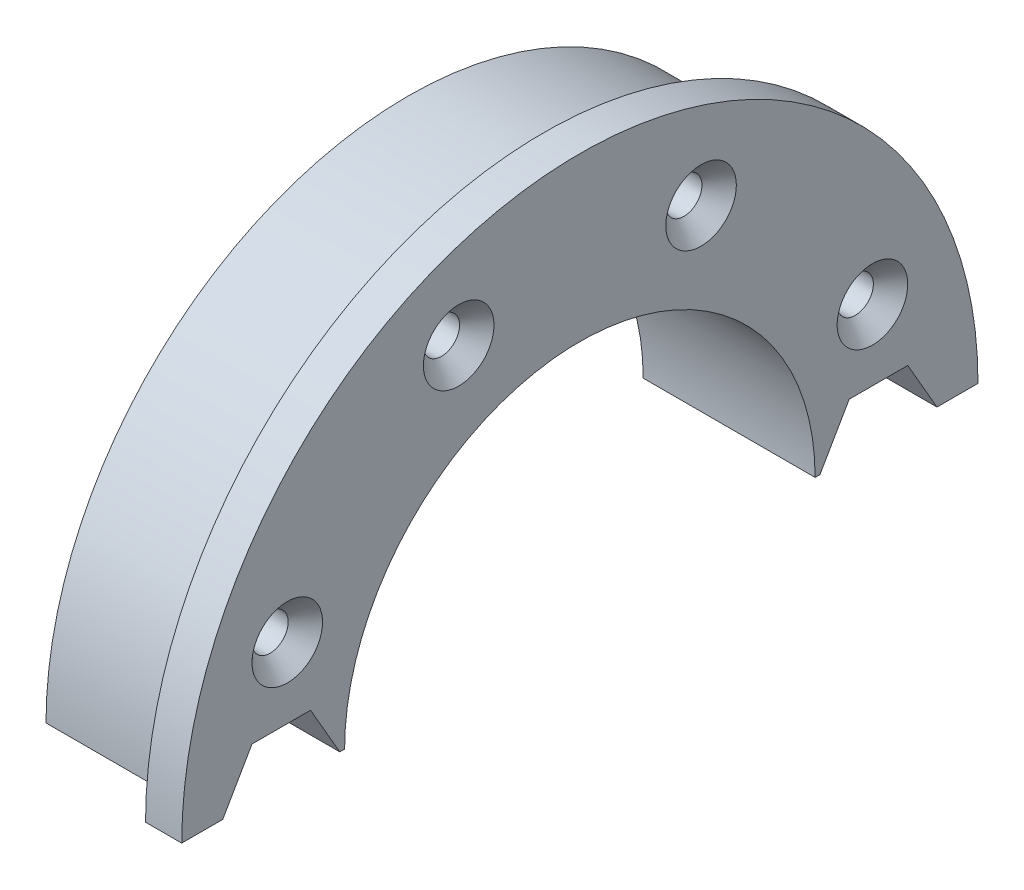
ISO-10303-21;
HEADER;
FILE_DESCRIPTION(('STEP AP214'),'2;1');
FILE_NAME('part.step','',(''),(''),'','','');
FILE_SCHEMA(('AUTOMOTIVE_DESIGN { 1 0 10303 214 1 1 1 1 }'));
ENDSEC;
DATA;
#1=APPLICATION_CONTEXT('core data for automotive mechanical design processes');
#2=APPLICATION_PROTOCOL_DEFINITION('international standard','automotive_design',2000,#1);
#3=PRODUCT_CONTEXT('',#1,'mechanical');
#4=PRODUCT('Part','Part','',(#3));
#5=PRODUCT_RELATED_PRODUCT_CATEGORY('part','',(#4));
#6=PRODUCT_DEFINITION_FORMATION('','',#4);
#7=PRODUCT_DEFINITION_CONTEXT('part definition',#1,'design');
#8=PRODUCT_DEFINITION('design','',#6,#7);
#9=PRODUCT_DEFINITION_SHAPE('','',#8);
#10=(LENGTH_UNIT() NAMED_UNIT(*) SI_UNIT(.MILLI.,.METRE.));
#11=(NAMED_UNIT(*) PLANE_ANGLE_UNIT() SI_UNIT($,.RADIAN.));
#12=(NAMED_UNIT(*) SI_UNIT($,.STERADIAN.) SOLID_ANGLE_UNIT());
#13=UNCERTAINTY_MEASURE_WITH_UNIT(LENGTH_MEASURE(1.E-05),#10,'distance_accuracy_value','');
#14=(GEOMETRIC_REPRESENTATION_CONTEXT(3) GLOBAL_UNCERTAINTY_ASSIGNED_CONTEXT((#13)) GLOBAL_UNIT_ASSIGNED_CONTEXT((#10,
#11,#12)) REPRESENTATION_CONTEXT('',''));
#15=CARTESIAN_POINT('',(0.,0.,0.));
#16=DIRECTION('',(0.,0.,1.));
#17=DIRECTION('',(1.,0.,0.));
#18=AXIS2_PLACEMENT_3D('',#15,#16,#17);
#19=CARTESIAN_POINT('',(0.,0.,0.));
#20=DIRECTION('',(0.,1.,0.));
#21=DIRECTION('',(-1.,0.,0.));
#22=AXIS2_PLACEMENT_3D('',#19,#20,#21);
#23=PLANE('',#22);
#24=DIRECTION('',(0.,0.,-1.));
#25=VECTOR('',#24,1.);
#26=CARTESIAN_POINT('',(1.5,0.,0.));
#27=LINE('',#26,#25);
#28=CARTESIAN_POINT('',(1.5,0.,14.9));
#29=VERTEX_POINT('',#28);
#30=CARTESIAN_POINT('',(1.5,0.,13.2668384925381));
#31=VERTEX_POINT('',#30);
#32=EDGE_CURVE('E225',#29,#31,#27,.T.);
#33=ORIENTED_EDGE('',*,*,#32,.F.);
#34=DIRECTION('',(-1.,0.,0.));
#35=VECTOR('',#34,1.);
#36=CARTESIAN_POINT('',(-4.,0.,14.9));
#37=LINE('',#36,#35);
#38=CARTESIAN_POINT('',(-1.9,0.,14.9));
#39=VERTEX_POINT('',#38);
#40=EDGE_CURVE('E41',#29,#39,#37,.T.);
#41=ORIENTED_EDGE('',*,*,#40,.T.);
#42=DIRECTION('',(0.,0.,-1.));
#43=VECTOR('',#42,1.);
#44=CARTESIAN_POINT('',(-1.9,0.,0.));
#45=LINE('',#44,#43);
#46=CARTESIAN_POINT('',(-1.9,0.,13.7));
#47=VERTEX_POINT('',#46);
#48=EDGE_CURVE('E187',#39,#47,#45,.T.);
#49=ORIENTED_EDGE('',*,*,#48,.T.);
#50=DIRECTION('',(-1.,0.,0.));
#51=VECTOR('',#50,1.);
#52=CARTESIAN_POINT('',(-4.,0.,13.7));
#53=LINE('',#52,#51);
#54=CARTESIAN_POINT('',(-4.,0.,13.7));
#55=VERTEX_POINT('',#54);
#56=EDGE_CURVE('E180',#47,#55,#53,.T.);
#57=ORIENTED_EDGE('',*,*,#56,.T.);
#58=DIRECTION('',(0.,0.,-1.));
#59=VECTOR('',#58,1.);
#60=CARTESIAN_POINT('',(-4.,0.,20.));
#61=LINE('',#60,#59);
#62=CARTESIAN_POINT('',(-3.99999999999999,0.,13.));
#63=VERTEX_POINT('',#62);
#64=EDGE_CURVE('E422',#55,#63,#61,.T.);
#65=ORIENTED_EDGE('',*,*,#64,.T.);
#66=DIRECTION('',(1.,0.,0.));
#67=VECTOR('',#66,1.);
#68=CARTESIAN_POINT('',(-3.99999999999999,0.,13.));
#69=LINE('',#68,#67);
#70=CARTESIAN_POINT('',(5.5,0.,13.));
#71=VERTEX_POINT('',#70);
#72=EDGE_CURVE('E425',#63,#71,#69,.T.);
#73=ORIENTED_EDGE('',*,*,#72,.T.);
#74=DIRECTION('',(0.,0.,1.));
#75=VECTOR('',#74,1.);
#76=CARTESIAN_POINT('',(5.5,0.,22.));
#77=LINE('',#76,#75);
#78=CARTESIAN_POINT('',(5.5,0.,13.2668384925381));
#79=VERTEX_POINT('',#78);
#80=EDGE_CURVE('E429',#71,#79,#77,.T.);
#81=ORIENTED_EDGE('',*,*,#80,.T.);
#82=DIRECTION('',(1.,0.,0.));
#83=VECTOR('',#82,1.);
#84=CARTESIAN_POINT('',(1.5,0.,13.2668384925381));
#85=LINE('',#84,#83);
#86=EDGE_CURVE('E374',#31,#79,#85,.T.);
#87=ORIENTED_EDGE('',*,*,#86,.F.);
#88=EDGE_LOOP('',(#33,#41,#49,#57,#65,#73,#81,#87));
#89=FACE_BOUND('',#88,.T.);
#90=ADVANCED_FACE('F33',(#89),#23,.F.);
#91=CARTESIAN_POINT('',(0.,0.,0.));
#92=DIRECTION('',(0.,-1.,0.));
#93=DIRECTION('',(-1.,0.,0.));
#94=AXIS2_PLACEMENT_3D('',#91,#92,#93);
#95=PLANE('',#94);
#96=DIRECTION('',(-1.,0.,0.));
#97=VECTOR('',#96,1.);
#98=CARTESIAN_POINT('',(-4.,0.,-18.1));
#99=LINE('',#98,#97);
#100=CARTESIAN_POINT('',(-1.9,0.,-18.1));
#101=VERTEX_POINT('',#100);
#102=CARTESIAN_POINT('',(1.5,0.,-18.1));
#103=VERTEX_POINT('',#102);
#104=EDGE_CURVE('E56',#101,#103,#99,.F.);
#105=ORIENTED_EDGE('',*,*,#104,.F.);
#106=DIRECTION('',(0.,0.,1.));
#107=VECTOR('',#106,1.);
#108=CARTESIAN_POINT('',(-1.9,0.,0.));
#109=LINE('',#108,#107);
#110=CARTESIAN_POINT('',(-1.9,0.,-19.3));
#111=VERTEX_POINT('',#110);
#112=EDGE_CURVE('E209',#111,#101,#109,.T.);
#113=ORIENTED_EDGE('',*,*,#112,.F.);
#114=DIRECTION('',(-1.,0.,0.));
#115=VECTOR('',#114,1.);
#116=CARTESIAN_POINT('',(-4.,0.,-19.3));
#117=LINE('',#116,#115);
#118=CARTESIAN_POINT('',(-4.,0.,-19.3));
#119=VERTEX_POINT('',#118);
#120=EDGE_CURVE('E207',#119,#111,#117,.F.);
#121=ORIENTED_EDGE('',*,*,#120,.F.);
#122=DIRECTION('',(0.,0.,1.));
#123=VECTOR('',#122,1.);
#124=CARTESIAN_POINT('',(-4.,0.,-20.));
#125=LINE('',#124,#123);
#126=CARTESIAN_POINT('',(-4.,0.,-20.));
#127=VERTEX_POINT('',#126);
#128=EDGE_CURVE('E442',#127,#119,#125,.T.);
#129=ORIENTED_EDGE('',*,*,#128,.F.);
#130=DIRECTION('',(-1.,0.,0.));
#131=VECTOR('',#130,1.);
#132=CARTESIAN_POINT('',(3.50000000000001,0.,-20.));
#133=LINE('',#132,#131);
#134=CARTESIAN_POINT('',(3.50000000000001,0.,-20.));
#135=VERTEX_POINT('',#134);
#136=EDGE_CURVE('E438',#135,#127,#133,.T.);
#137=ORIENTED_EDGE('',*,*,#136,.F.);
#138=DIRECTION('',(0.,0.,1.));
#139=VECTOR('',#138,1.);
#140=CARTESIAN_POINT('',(3.50000000000001,0.,-20.));
#141=LINE('',#140,#139);
#142=CARTESIAN_POINT('',(3.50000000000001,0.,-22.));
#143=VERTEX_POINT('',#142);
#144=EDGE_CURVE('E435',#143,#135,#141,.T.);
#145=ORIENTED_EDGE('',*,*,#144,.F.);
#146=DIRECTION('',(-1.,0.,0.));
#147=VECTOR('',#146,1.);
#148=CARTESIAN_POINT('',(3.50000000000001,0.,-22.));
#149=LINE('',#148,#147);
#150=CARTESIAN_POINT('',(5.5,0.,-22.));
#151=VERTEX_POINT('',#150);
#152=EDGE_CURVE('E452',#151,#143,#149,.T.);
#153=ORIENTED_EDGE('',*,*,#152,.F.);
#154=DIRECTION('',(0.,0.,-1.));
#155=VECTOR('',#154,1.);
#156=CARTESIAN_POINT('',(5.5,0.,-22.));
#157=LINE('',#156,#155);
#158=CARTESIAN_POINT('',(5.5,0.,-19.7331615074619));
#159=VERTEX_POINT('',#158);
#160=EDGE_CURVE('E448',#159,#151,#157,.T.);
#161=ORIENTED_EDGE('',*,*,#160,.F.);
#162=DIRECTION('',(1.,0.,0.));
#163=VECTOR('',#162,1.);
#164=CARTESIAN_POINT('',(1.5,0.,-19.7331615074619));
#165=LINE('',#164,#163);
#166=CARTESIAN_POINT('',(1.5,0.,-19.7331615074619));
#167=VERTEX_POINT('',#166);
#168=EDGE_CURVE('E342',#167,#159,#165,.T.);
#169=ORIENTED_EDGE('',*,*,#168,.F.);
#170=DIRECTION('',(0.,0.,-1.));
#171=VECTOR('',#170,1.);
#172=CARTESIAN_POINT('',(1.5,0.,0.));
#173=LINE('',#172,#171);
#174=EDGE_CURVE('E221',#103,#167,#173,.T.);
#175=ORIENTED_EDGE('',*,*,#174,.F.);
#176=EDGE_LOOP('',(#105,#113,#121,#129,#137,#145,#153,#161,#169,#175));
#177=FACE_BOUND('',#176,.T.);
#178=ADVANCED_FACE('F297',(#177),#95,.T.);
#179=CARTESIAN_POINT('',(3.50000000000001,0.,-20.));
#180=DIRECTION('',(-1.,0.,0.));
#181=DIRECTION('',(0.,-1.,0.));
#182=AXIS2_PLACEMENT_3D('',#179,#180,#181);
#183=PLANE('',#182);
#184=CARTESIAN_POINT('',(3.50000000000001,0.,0.));
#185=DIRECTION('',(1.,0.,0.));
#186=DIRECTION('',(0.,1.,0.));
#187=AXIS2_PLACEMENT_3D('',#184,#185,#186);
#188=CIRCLE('',#187,22.);
#189=CARTESIAN_POINT('',(3.50000000000001,0.,22.));
#190=VERTEX_POINT('',#189);
#191=EDGE_CURVE('E467',#143,#190,#188,.T.);
#192=ORIENTED_EDGE('',*,*,#191,.F.);
#193=ORIENTED_EDGE('',*,*,#144,.T.);
#194=CARTESIAN_POINT('',(3.50000000000001,0.,0.));
#195=DIRECTION('',(1.,0.,0.));
#196=DIRECTION('',(0.,1.,0.));
#197=AXIS2_PLACEMENT_3D('',#194,#195,#196);
#198=CIRCLE('',#197,20.);
#199=CARTESIAN_POINT('',(3.50000000000001,0.,20.));
#200=VERTEX_POINT('',#199);
#201=EDGE_CURVE('E455',#135,#200,#198,.T.);
#202=ORIENTED_EDGE('',*,*,#201,.T.);
#203=DIRECTION('',(0.,0.,-1.));
#204=VECTOR('',#203,1.);
#205=CARTESIAN_POINT('',(3.50000000000001,0.,20.));
#206=LINE('',#205,#204);
#207=EDGE_CURVE('E416',#190,#200,#206,.T.);
#208=ORIENTED_EDGE('',*,*,#207,.F.);
#209=EDGE_LOOP('',(#192,#193,#202,#208));
#210=FACE_BOUND('',#209,.T.);
#211=ADVANCED_FACE('F298',(#210),#183,.T.);
#212=CARTESIAN_POINT('',(0.,0.,0.));
#213=DIRECTION('',(1.,0.,0.));
#214=DIRECTION('',(0.,1.,0.));
#215=AXIS2_PLACEMENT_3D('',#212,#213,#214);
#216=CYLINDRICAL_SURFACE('',#215,22.);
#217=CARTESIAN_POINT('',(5.5,0.,0.));
#218=DIRECTION('',(1.,0.,0.));
#219=DIRECTION('',(0.,1.,0.));
#220=AXIS2_PLACEMENT_3D('',#217,#218,#219);
#221=CIRCLE('',#220,22.);
#222=CARTESIAN_POINT('',(5.5,0.,22.));
#223=VERTEX_POINT('',#222);
#224=EDGE_CURVE('E464',#151,#223,#221,.T.);
#225=ORIENTED_EDGE('',*,*,#224,.F.);
#226=ORIENTED_EDGE('',*,*,#152,.T.);
#227=ORIENTED_EDGE('',*,*,#191,.T.);
#228=DIRECTION('',(-1.,0.,0.));
#229=VECTOR('',#228,1.);
#230=CARTESIAN_POINT('',(3.50000000000001,0.,22.));
#231=LINE('',#230,#229);
#232=EDGE_CURVE('E432',#223,#190,#231,.T.);
#233=ORIENTED_EDGE('',*,*,#232,.F.);
#234=EDGE_LOOP('',(#225,#226,#227,#233));
#235=FACE_BOUND('',#234,.T.);
#236=ADVANCED_FACE('F35',(#235),#216,.T.);
#237=CARTESIAN_POINT('',(5.5,0.,-22.));
#238=DIRECTION('',(1.,0.,0.));
#239=DIRECTION('',(0.,1.,0.));
#240=AXIS2_PLACEMENT_3D('',#237,#238,#239);
#241=PLANE('',#240);
#242=DIRECTION('',(0.,-0.866025403784439,0.5));
#243=VECTOR('',#242,1.);
#244=CARTESIAN_POINT('',(5.5,0.,-13.2668384925381));
#245=LINE('',#244,#243);
#246=CARTESIAN_POINT('',(5.5,2.79999999999996,-14.8834192462691));
#247=VERTEX_POINT('',#246);
#248=CARTESIAN_POINT('',(5.5,0.,-13.2668384925381));
#249=VERTEX_POINT('',#248);
#250=EDGE_CURVE('E337',#247,#249,#245,.T.);
#251=ORIENTED_EDGE('',*,*,#250,.F.);
#252=DIRECTION('',(0.,0.,1.));
#253=VECTOR('',#252,1.);
#254=CARTESIAN_POINT('',(5.5,2.79999999999996,-14.8834192462691));
#255=LINE('',#254,#253);
#256=CARTESIAN_POINT('',(5.5,2.79999999999996,-18.116580753731));
#257=VERTEX_POINT('',#256);
#258=EDGE_CURVE('E345',#257,#247,#255,.T.);
#259=ORIENTED_EDGE('',*,*,#258,.F.);
#260=DIRECTION('',(0.,0.866025403784439,0.5));
#261=VECTOR('',#260,1.);
#262=CARTESIAN_POINT('',(5.5,2.79999999999996,-18.116580753731));
#263=LINE('',#262,#261);
#264=EDGE_CURVE('E327',#159,#257,#263,.T.);
#265=ORIENTED_EDGE('',*,*,#264,.F.);
#266=ORIENTED_EDGE('',*,*,#160,.T.);
#267=ORIENTED_EDGE('',*,*,#224,.T.);
#268=CARTESIAN_POINT('',(5.5,0.,19.7331615074619));
#269=VERTEX_POINT('',#268);
#270=EDGE_CURVE('E428',#269,#223,#77,.T.);
#271=ORIENTED_EDGE('',*,*,#270,.F.);
#272=DIRECTION('',(0.,-0.866025403784439,0.5));
#273=VECTOR('',#272,1.);
#274=CARTESIAN_POINT('',(5.5,2.79999999999995,18.116580753731));
#275=LINE('',#274,#273);
#276=CARTESIAN_POINT('',(5.5,2.79999999999995,18.116580753731));
#277=VERTEX_POINT('',#276);
#278=EDGE_CURVE('E362',#277,#269,#275,.T.);
#279=ORIENTED_EDGE('',*,*,#278,.F.);
#280=DIRECTION('',(0.,0.,1.));
#281=VECTOR('',#280,1.);
#282=CARTESIAN_POINT('',(5.5,2.79999999999996,14.883419246269));
#283=LINE('',#282,#281);
#284=CARTESIAN_POINT('',(5.5,2.79999999999996,14.883419246269));
#285=VERTEX_POINT('',#284);
#286=EDGE_CURVE('E370',#285,#277,#283,.T.);
#287=ORIENTED_EDGE('',*,*,#286,.F.);
#288=DIRECTION('',(0.,0.866025403784439,0.5));
#289=VECTOR('',#288,1.);
#290=CARTESIAN_POINT('',(5.5,0.,13.2668384925381));
#291=LINE('',#290,#289);
#292=EDGE_CURVE('E352',#79,#285,#291,.T.);
#293=ORIENTED_EDGE('',*,*,#292,.F.);
#294=ORIENTED_EDGE('',*,*,#80,.F.);
#295=CARTESIAN_POINT('',(5.5,0.,0.));
#296=DIRECTION('',(1.,0.,0.));
#297=DIRECTION('',(0.,1.,0.));
#298=AXIS2_PLACEMENT_3D('',#295,#296,#297);
#299=CIRCLE('',#298,13.);
#300=CARTESIAN_POINT('',(5.5,0.,-13.));
#301=VERTEX_POINT('',#300);
#302=EDGE_CURVE('E462',#301,#71,#299,.T.);
#303=ORIENTED_EDGE('',*,*,#302,.F.);
#304=EDGE_CURVE('E449',#301,#249,#157,.T.);
#305=ORIENTED_EDGE('',*,*,#304,.T.);
#306=EDGE_LOOP('',(#251,#259,#265,#266,#267,#271,#279,#287,#293,#294,#303,#305));
#307=FACE_BOUND('',#306,.T.);
#308=CARTESIAN_POINT('',(5.5,16.1678918189476,-6.69696006638897));
#309=DIRECTION('',(1.,0.,0.));
#310=DIRECTION('',(0.,0.,-1.));
#311=AXIS2_PLACEMENT_3D('',#308,#309,#310);
#312=CIRCLE('',#311,1.95);
#313=CARTESIAN_POINT('',(5.5,16.1678918189476,-8.64696006638897));
#314=VERTEX_POINT('',#313);
#315=EDGE_CURVE('E404',#314,#314,#312,.T.);
#316=ORIENTED_EDGE('',*,*,#315,.F.);
#317=EDGE_LOOP('',(#316));
#318=FACE_BOUND('',#317,.T.);
#319=CARTESIAN_POINT('',(5.5,6.69696006638914,16.1678918189475));
#320=DIRECTION('',(1.,0.,0.));
#321=DIRECTION('',(0.,0.,-1.));
#322=AXIS2_PLACEMENT_3D('',#319,#320,#321);
#323=CIRCLE('',#322,1.95);
#324=CARTESIAN_POINT('',(5.5,6.69696006638914,14.2178918189475));
#325=VERTEX_POINT('',#324);
#326=EDGE_CURVE('E407',#325,#325,#323,.T.);
#327=ORIENTED_EDGE('',*,*,#326,.F.);
#328=EDGE_LOOP('',(#327));
#329=FACE_BOUND('',#328,.T.);
#330=CARTESIAN_POINT('',(5.5,16.1678918189476,6.69696006638897));
#331=DIRECTION('',(1.,0.,0.));
#332=DIRECTION('',(0.,0.,-1.));
#333=AXIS2_PLACEMENT_3D('',#330,#331,#332);
#334=CIRCLE('',#333,1.95);
#335=CARTESIAN_POINT('',(5.5,16.1678918189476,4.74696006638897));
#336=VERTEX_POINT('',#335);
#337=EDGE_CURVE('E410',#336,#336,#334,.T.);
#338=ORIENTED_EDGE('',*,*,#337,.F.);
#339=EDGE_LOOP('',(#338));
#340=FACE_BOUND('',#339,.T.);
#341=CARTESIAN_POINT('',(5.5,6.69696006638914,-16.1678918189475));
#342=DIRECTION('',(1.,0.,0.));
#343=DIRECTION('',(0.,0.,-1.));
#344=AXIS2_PLACEMENT_3D('',#341,#342,#343);
#345=CIRCLE('',#344,1.95);
#346=CARTESIAN_POINT('',(5.5,6.69696006638914,-18.1178918189475));
#347=VERTEX_POINT('',#346);
#348=EDGE_CURVE('E413',#347,#347,#345,.T.);
#349=ORIENTED_EDGE('',*,*,#348,.F.);
#350=EDGE_LOOP('',(#349));
#351=FACE_BOUND('',#350,.T.);
#352=ADVANCED_FACE('F310',(#307,#318,#329,#340,#351),#241,.T.);
#353=CARTESIAN_POINT('',(0.,0.,0.));
#354=DIRECTION('',(1.,0.,0.));
#355=DIRECTION('',(0.,1.,0.));
#356=AXIS2_PLACEMENT_3D('',#353,#354,#355);
#357=CYLINDRICAL_SURFACE('',#356,13.);
#358=CARTESIAN_POINT('',(0.,12.5199840255489,3.5));
#359=CARTESIAN_POINT('',(-0.192733863047661,12.519987296716,3.49999549519347));
#360=CARTESIAN_POINT('',(-0.385515096632069,12.524483128281,3.48402590639408));
#361=CARTESIAN_POINT('',(-0.765505006520177,12.5419256135071,3.4206936936162));
#362=CARTESIAN_POINT('',(-0.952710910521182,12.5548764003399,3.37331571559502));
#363=CARTESIAN_POINT('',(-1.31599802020266,12.5876580830299,3.24884102166018));
#364=CARTESIAN_POINT('',(-1.49209465987786,12.607479173612,3.17178664248479));
#365=CARTESIAN_POINT('',(-1.82889010121309,12.651755568969,2.99027958721716));
#366=CARTESIAN_POINT('',(-1.98958762071002,12.6762112591264,2.88582463239696));
#367=CARTESIAN_POINT('',(-2.29512013701213,12.7276999993569,2.64963367151912));
#368=CARTESIAN_POINT('',(-2.43950441372208,12.754779446129,2.51732461446255));
#369=CARTESIAN_POINT('',(-2.70432531683488,12.8080643763935,2.23041334209183));
#370=CARTESIAN_POINT('',(-2.82475941986894,12.8342697675543,2.07580878070064));
#371=CARTESIAN_POINT('',(-3.0401464316768,12.8833723619612,1.74556390099492));
#372=CARTESIAN_POINT('',(-3.13465041425444,12.906208454915,1.5696209154537));
#373=CARTESIAN_POINT('',(-3.29256540458967,12.9454666011239,1.20362570616068));
#374=CARTESIAN_POINT('',(-3.35598176056886,12.9618897575422,1.01357591578329));
#375=CARTESIAN_POINT('',(-3.44846021674956,12.9861435015839,0.629467337231833));
#376=CARTESIAN_POINT('',(-3.47828922077597,12.9941655989057,0.43560549466014));
#377=CARTESIAN_POINT('',(-3.50515994281195,13.0013832936427,0.0454743160626951));
#378=CARTESIAN_POINT('',(-3.50220725042572,13.0005803958072,-0.150794603831767));
#379=CARTESIAN_POINT('',(-3.4641366104446,12.9903785233819,-0.534827555382237));
#380=CARTESIAN_POINT('',(-3.4298473701431,12.9812010276732,-0.722680523614952));
#381=CARTESIAN_POINT('',(-3.33141687181327,12.9555430655096,-1.08986074525301));
#382=CARTESIAN_POINT('',(-3.26727389524758,12.9390621786359,-1.26918750719021));
#383=CARTESIAN_POINT('',(-3.11032707514458,12.9003223734702,-1.61632971517296));
#384=CARTESIAN_POINT('',(-3.01724102090121,12.8780069217084,-1.78401100229275));
#385=CARTESIAN_POINT('',(-2.80526747087453,12.8299997134111,-2.10165430359395));
#386=CARTESIAN_POINT('',(-2.68637486205899,12.8043072881971,-2.25161279726566));
#387=CARTESIAN_POINT('',(-2.42177114411394,12.751379786537,-2.53450040287499));
#388=CARTESIAN_POINT('',(-2.2753375409341,12.7241215942174,-2.66675019174581));
#389=CARTESIAN_POINT('',(-1.96208933810539,12.6718581381745,-2.90498324094264));
#390=CARTESIAN_POINT('',(-1.79527344665645,12.6468530174223,-3.01096483513776));
#391=CARTESIAN_POINT('',(-1.44450019387853,12.6018327445426,-3.19418368769253));
#392=CARTESIAN_POINT('',(-1.26044009662334,12.5818505040583,-3.27123291547011));
#393=CARTESIAN_POINT('',(-0.881305734908542,12.549545700142,-3.39306935891719));
#394=CARTESIAN_POINT('',(-0.686234276228113,12.5372211949853,-3.43786475345031));
#395=CARTESIAN_POINT('',(-0.296976079152484,12.5220418906455,-3.49274373273676));
#396=CARTESIAN_POINT('',(-0.102943041402552,12.5189103489814,-3.50384208731417));
#397=CARTESIAN_POINT('',(0.284207068392758,12.5217137775334,-3.49381061586358));
#398=CARTESIAN_POINT('',(0.477324237772778,12.5276477616154,-3.47268429518708));
#399=CARTESIAN_POINT('',(0.853227799529959,12.5476459905554,-3.39969849099894));
#400=CARTESIAN_POINT('',(1.03614271718026,12.5615479019907,-3.34845213783084));
#401=CARTESIAN_POINT('',(1.3907801403329,12.5957562975991,-3.21737191151462));
#402=CARTESIAN_POINT('',(1.56250115988541,12.6160636299881,-3.13753425207075));
#403=CARTESIAN_POINT('',(1.89411322308293,12.6613604504911,-2.94948758645572));
#404=CARTESIAN_POINT('',(2.05365411775228,12.6864444351079,-2.84068439890221));
#405=CARTESIAN_POINT('',(2.35258611257341,12.7382473615765,-2.59852942643471));
#406=CARTESIAN_POINT('',(2.49197333986039,12.7649666162725,-2.46517293435572));
#407=CARTESIAN_POINT('',(2.75087013513505,12.8179845860458,-2.17299738605274));
#408=CARTESIAN_POINT('',(2.86967116184005,12.8442475824537,-2.01354270656174));
#409=CARTESIAN_POINT('',(3.07882186859405,12.8925853490478,-1.67636659691593));
#410=CARTESIAN_POINT('',(3.16917306354108,12.9146603422122,-1.49864614004676));
#411=CARTESIAN_POINT('',(3.31802438267537,12.9519925293136,-1.131234417385));
#412=CARTESIAN_POINT('',(3.37676315102568,12.9673006451773,-0.941645259625267));
#413=CARTESIAN_POINT('',(3.46141013700837,12.9895985134991,-0.554812588740277));
#414=CARTESIAN_POINT('',(3.48732578159755,12.9965901477231,-0.357570817601865));
#415=CARTESIAN_POINT('',(3.50511813118898,13.0013765262741,0.0323541676710968));
#416=CARTESIAN_POINT('',(3.4980332378149,12.9994518437535,0.224987219470408));
#417=CARTESIAN_POINT('',(3.45244189968834,12.9872583104364,0.606213937392002));
#418=CARTESIAN_POINT('',(3.41393667561298,12.9769897837977,0.794807760145879));
#419=CARTESIAN_POINT('',(3.30718934843267,12.9493199142889,1.16132788824944));
#420=CARTESIAN_POINT('',(3.23916153316336,12.9319700240626,1.3393207461674));
#421=CARTESIAN_POINT('',(3.07549118165246,12.8919498743966,1.68146741177218));
#422=CARTESIAN_POINT('',(2.97984471535724,12.8692788578621,1.84561924562354));
#423=CARTESIAN_POINT('',(2.76063322764439,12.8202731094063,2.16024386111701));
#424=CARTESIAN_POINT('',(2.63638235112232,12.7938557935363,2.3102258761489));
#425=CARTESIAN_POINT('',(2.36478498590338,12.740663484316,2.58756191756354));
#426=CARTESIAN_POINT('',(2.21743238969311,12.7138883980977,2.71490994103776));
#427=CARTESIAN_POINT('',(1.8998194332551,12.6623160478465,2.94620800831808));
#428=CARTESIAN_POINT('',(1.72911762602087,12.6375769609281,3.04956601831785));
#429=CARTESIAN_POINT('',(1.37211457473379,12.5937060232643,3.22597052412398));
#430=CARTESIAN_POINT('',(1.18582343862542,12.5745705748519,3.29903648072156));
#431=CARTESIAN_POINT('',(0.833567875515348,12.5466760265742,3.40343047114246));
#432=CARTESIAN_POINT('',(0.669103006567813,12.5367484503479,3.43955800634852));
#433=CARTESIAN_POINT('',(0.336437157937175,12.523401409923,3.4878433086631));
#434=CARTESIAN_POINT('',(0.168236625899547,12.5199811701601,3.50000393222778));
#435=CARTESIAN_POINT('',(0.,12.5199840255489,3.5));
#436=B_SPLINE_CURVE_WITH_KNOTS('',3,(#358,#359,#360,#361,#362,#363,#364,#365,#366,#367,#368,
#369,#370,#371,#372,#373,#374,#375,#376,#377,#378,#379,#380,#381,#382,#383,#384,#385,#386,#387,
#388,#389,#390,#391,#392,#393,#394,#395,#396,#397,#398,#399,#400,#401,#402,#403,#404,#405,#406,
#407,#408,#409,#410,#411,#412,#413,#414,#415,#416,#417,#418,#419,#420,#421,#422,#423,#424,#425,
#426,#427,#428,#429,#430,#431,#432,#433,#434,#435),.UNSPECIFIED.,.T.,.F.,(4,2,2,2,2,2,2,2,2,2,2,
2,2,2,2,2,2,2,2,2,2,2,2,2,2,2,2,2,2,2,2,2,2,2,2,2,2,2,4),(0.,0.577582820274928,1.15544820127544,
1.73249222759724,2.3095842581464,2.89997106648218,3.4904200445251,4.09052514979438,
4.69052697852662,5.27653199045544,5.86243708425545,6.43328242265929,7.00416062597431,
7.58078966258638,8.15753305070723,8.75231520003574,9.3471350653727,9.94575635977022,
10.5442258034455,11.1244843961512,11.7046798737045,12.2734549091097,12.8423052942496,
13.4238686252107,14.005543565197,14.6043954784861,15.2032154986849,15.7974492184857,
16.3915484557454,16.9670822199683,17.5425936258189,18.113995812994,18.6854793491389,
19.2724376719862,19.8595514343359,20.4598976120913,21.0598575042499,21.5640873604784,
22.0682571172822),.UNSPECIFIED.);
#437=CARTESIAN_POINT('',(0.,12.5199840255489,3.5));
#438=VERTEX_POINT('',#437);
#439=EDGE_CURVE('E226',#438,#438,#436,.T.);
#440=ORIENTED_EDGE('',*,*,#439,.F.);
#441=EDGE_LOOP('',(#440));
#442=FACE_BOUND('',#441,.T.);
#443=CARTESIAN_POINT('',(-3.99999999999999,0.,0.));
#444=DIRECTION('',(1.,0.,0.));
#445=DIRECTION('',(0.,1.,0.));
#446=AXIS2_PLACEMENT_3D('',#443,#444,#445);
#447=CIRCLE('',#446,13.);
#448=CARTESIAN_POINT('',(-3.99999999999999,0.,-13.));
#449=VERTEX_POINT('',#448);
#450=EDGE_CURVE('E459',#449,#63,#447,.T.);
#451=ORIENTED_EDGE('',*,*,#450,.F.);
#452=DIRECTION('',(1.,0.,0.));
#453=VECTOR('',#452,1.);
#454=CARTESIAN_POINT('',(-3.99999999999999,0.,-13.));
#455=LINE('',#454,#453);
#456=EDGE_CURVE('E445',#449,#301,#455,.T.);
#457=ORIENTED_EDGE('',*,*,#456,.T.);
#458=ORIENTED_EDGE('',*,*,#302,.T.);
#459=ORIENTED_EDGE('',*,*,#72,.F.);
#460=EDGE_LOOP('',(#451,#457,#458,#459));
#461=FACE_BOUND('',#460,.T.);
#462=ADVANCED_FACE('F237',(#442,#461),#357,.F.);
#463=CARTESIAN_POINT('',(-4.,0.,-20.));
#464=DIRECTION('',(-1.,0.,0.));
#465=DIRECTION('',(0.,-1.,0.));
#466=AXIS2_PLACEMENT_3D('',#463,#464,#465);
#467=PLANE('',#466);
#468=CARTESIAN_POINT('',(-4.,0.,16.5));
#469=DIRECTION('',(-1.,0.,0.));
#470=DIRECTION('',(0.,0.,1.));
#471=AXIS2_PLACEMENT_3D('',#468,#469,#470);
#472=CIRCLE('',#471,2.8);
#473=CARTESIAN_POINT('',(-4.,0.,19.3));
#474=VERTEX_POINT('',#473);
#475=EDGE_CURVE('E183',#474,#55,#472,.T.);
#476=ORIENTED_EDGE('',*,*,#475,.F.);
#477=CARTESIAN_POINT('',(-4.,0.,20.));
#478=VERTEX_POINT('',#477);
#479=EDGE_CURVE('E423',#478,#474,#61,.T.);
#480=ORIENTED_EDGE('',*,*,#479,.F.);
#481=CARTESIAN_POINT('',(-4.,0.,0.));
#482=DIRECTION('',(1.,0.,0.));
#483=DIRECTION('',(0.,1.,0.));
#484=AXIS2_PLACEMENT_3D('',#481,#482,#483);
#485=CIRCLE('',#484,20.);
#486=EDGE_CURVE('E457',#127,#478,#485,.T.);
#487=ORIENTED_EDGE('',*,*,#486,.F.);
#488=ORIENTED_EDGE('',*,*,#128,.T.);
#489=CARTESIAN_POINT('',(-4.,0.,-16.5));
#490=DIRECTION('',(-1.,0.,0.));
#491=DIRECTION('',(0.,0.,1.));
#492=AXIS2_PLACEMENT_3D('',#489,#490,#491);
#493=CIRCLE('',#492,2.8);
#494=CARTESIAN_POINT('',(-4.,0.,-13.7));
#495=VERTEX_POINT('',#494);
#496=EDGE_CURVE('E541',#495,#119,#493,.T.);
#497=ORIENTED_EDGE('',*,*,#496,.F.);
#498=EDGE_CURVE('E441',#495,#449,#125,.T.);
#499=ORIENTED_EDGE('',*,*,#498,.T.);
#500=ORIENTED_EDGE('',*,*,#450,.T.);
#501=ORIENTED_EDGE('',*,*,#64,.F.);
#502=EDGE_LOOP('',(#476,#480,#487,#488,#497,#499,#500,#501));
#503=FACE_BOUND('',#502,.T.);
#504=CARTESIAN_POINT('',(-4.,6.69696006638914,16.1678918189475));
#505=DIRECTION('',(1.,0.,0.));
#506=DIRECTION('',(0.,1.,0.));
#507=AXIS2_PLACEMENT_3D('',#504,#505,#506);
#508=CIRCLE('',#507,1.);
#509=CARTESIAN_POINT('',(-4.,7.69696006638914,16.1678918189475));
#510=VERTEX_POINT('',#509);
#511=EDGE_CURVE('E389',#510,#510,#508,.T.);
#512=ORIENTED_EDGE('',*,*,#511,.T.);
#513=EDGE_LOOP('',(#512));
#514=FACE_BOUND('',#513,.T.);
#515=CARTESIAN_POINT('',(-4.,6.69696006638914,-16.1678918189475));
#516=DIRECTION('',(1.,0.,0.));
#517=DIRECTION('',(0.,1.,0.));
#518=AXIS2_PLACEMENT_3D('',#515,#516,#517);
#519=CIRCLE('',#518,1.);
#520=CARTESIAN_POINT('',(-4.,7.69696006638914,-16.1678918189475));
#521=VERTEX_POINT('',#520);
#522=EDGE_CURVE('E392',#521,#521,#519,.T.);
#523=ORIENTED_EDGE('',*,*,#522,.T.);
#524=EDGE_LOOP('',(#523));
#525=FACE_BOUND('',#524,.T.);
#526=CARTESIAN_POINT('',(-4.00000000000001,16.1678918189476,-6.69696006638897));
#527=DIRECTION('',(1.,0.,0.));
#528=DIRECTION('',(0.,1.,0.));
#529=AXIS2_PLACEMENT_3D('',#526,#527,#528);
#530=CIRCLE('',#529,1.);
#531=CARTESIAN_POINT('',(-4.00000000000001,17.1678918189476,-6.69696006638897));
#532=VERTEX_POINT('',#531);
#533=EDGE_CURVE('E396',#532,#532,#530,.T.);
#534=ORIENTED_EDGE('',*,*,#533,.T.);
#535=EDGE_LOOP('',(#534));
#536=FACE_BOUND('',#535,.T.);
#537=CARTESIAN_POINT('',(-4.00000000000001,16.1678918189476,6.69696006638897));
#538=DIRECTION('',(1.,0.,0.));
#539=DIRECTION('',(0.,1.,0.));
#540=AXIS2_PLACEMENT_3D('',#537,#538,#539);
#541=CIRCLE('',#540,1.);
#542=CARTESIAN_POINT('',(-4.00000000000001,17.1678918189476,6.69696006638897));
#543=VERTEX_POINT('',#542);
#544=EDGE_CURVE('E400',#543,#543,#541,.T.);
#545=ORIENTED_EDGE('',*,*,#544,.T.);
#546=EDGE_LOOP('',(#545));
#547=FACE_BOUND('',#546,.T.);
#548=ADVANCED_FACE('F303',(#503,#514,#525,#536,#547),#467,.T.);
#549=CARTESIAN_POINT('',(0.,0.,0.));
#550=DIRECTION('',(1.,0.,0.));
#551=DIRECTION('',(0.,1.,0.));
#552=AXIS2_PLACEMENT_3D('',#549,#550,#551);
#553=CYLINDRICAL_SURFACE('',#552,20.);
#554=ORIENTED_EDGE('',*,*,#136,.T.);
#555=ORIENTED_EDGE('',*,*,#486,.T.);
#556=DIRECTION('',(-1.,0.,0.));
#557=VECTOR('',#556,1.);
#558=CARTESIAN_POINT('',(3.50000000000001,0.,20.));
#559=LINE('',#558,#557);
#560=EDGE_CURVE('E419',#200,#478,#559,.T.);
#561=ORIENTED_EDGE('',*,*,#560,.F.);
#562=ORIENTED_EDGE('',*,*,#201,.F.);
#563=EDGE_LOOP('',(#554,#555,#561,#562));
#564=FACE_BOUND('',#563,.T.);
#565=ADVANCED_FACE('F295',(#564),#553,.T.);
#566=DIRECTION('',(-1.,0.,0.));
#567=VECTOR('',#566,1.);
#568=CARTESIAN_POINT('',(-4.,0.,-14.9));
#569=LINE('',#568,#567);
#570=CARTESIAN_POINT('',(1.5,0.,-14.9));
#571=VERTEX_POINT('',#570);
#572=CARTESIAN_POINT('',(-1.9,0.,-14.9));
#573=VERTEX_POINT('',#572);
#574=EDGE_CURVE('E324',#571,#573,#569,.T.);
#575=ORIENTED_EDGE('',*,*,#574,.F.);
#576=CARTESIAN_POINT('',(1.5,0.,-13.2668384925381));
#577=VERTEX_POINT('',#576);
#578=EDGE_CURVE('E218',#577,#571,#173,.T.);
#579=ORIENTED_EDGE('',*,*,#578,.F.);
#580=DIRECTION('',(1.,0.,0.));
#581=VECTOR('',#580,1.);
#582=CARTESIAN_POINT('',(1.5,0.,-13.2668384925381));
#583=LINE('',#582,#581);
#584=EDGE_CURVE('E349',#577,#249,#583,.T.);
#585=ORIENTED_EDGE('',*,*,#584,.T.);
#586=ORIENTED_EDGE('',*,*,#304,.F.);
#587=ORIENTED_EDGE('',*,*,#456,.F.);
#588=ORIENTED_EDGE('',*,*,#498,.F.);
#589=DIRECTION('',(-1.,0.,0.));
#590=VECTOR('',#589,1.);
#591=CARTESIAN_POINT('',(-4.,0.,-13.7));
#592=LINE('',#591,#590);
#593=CARTESIAN_POINT('',(-1.9,0.,-13.7));
#594=VERTEX_POINT('',#593);
#595=EDGE_CURVE('E212',#594,#495,#592,.T.);
#596=ORIENTED_EDGE('',*,*,#595,.F.);
#597=EDGE_CURVE('E214',#573,#594,#109,.T.);
#598=ORIENTED_EDGE('',*,*,#597,.F.);
#599=EDGE_LOOP('',(#575,#579,#585,#586,#587,#588,#596,#598));
#600=FACE_BOUND('',#599,.T.);
#601=ADVANCED_FACE('F292',(#600),#95,.T.);
#602=CARTESIAN_POINT('',(-1.9,0.,19.3));
#603=VERTEX_POINT('',#602);
#604=CARTESIAN_POINT('',(-1.9,0.,18.1));
#605=VERTEX_POINT('',#604);
#606=EDGE_CURVE('E195',#603,#605,#45,.T.);
#607=ORIENTED_EDGE('',*,*,#606,.T.);
#608=DIRECTION('',(-1.,0.,0.));
#609=VECTOR('',#608,1.);
#610=CARTESIAN_POINT('',(-4.,0.,18.1));
#611=LINE('',#610,#609);
#612=CARTESIAN_POINT('',(1.5,0.,18.1));
#613=VERTEX_POINT('',#612);
#614=EDGE_CURVE('E188',#605,#613,#611,.F.);
#615=ORIENTED_EDGE('',*,*,#614,.T.);
#616=CARTESIAN_POINT('',(1.5,0.,19.7331615074619));
#617=VERTEX_POINT('',#616);
#618=EDGE_CURVE('E222',#617,#613,#27,.T.);
#619=ORIENTED_EDGE('',*,*,#618,.F.);
#620=DIRECTION('',(1.,0.,0.));
#621=VECTOR('',#620,1.);
#622=CARTESIAN_POINT('',(1.5,0.,19.7331615074619));
#623=LINE('',#622,#621);
#624=EDGE_CURVE('E377',#617,#269,#623,.T.);
#625=ORIENTED_EDGE('',*,*,#624,.T.);
#626=ORIENTED_EDGE('',*,*,#270,.T.);
#627=ORIENTED_EDGE('',*,*,#232,.T.);
#628=ORIENTED_EDGE('',*,*,#207,.T.);
#629=ORIENTED_EDGE('',*,*,#560,.T.);
#630=ORIENTED_EDGE('',*,*,#479,.T.);
#631=DIRECTION('',(-1.,0.,0.));
#632=VECTOR('',#631,1.);
#633=CARTESIAN_POINT('',(-4.,0.,19.3));
#634=LINE('',#633,#632);
#635=EDGE_CURVE('E204',#474,#603,#634,.F.);
#636=ORIENTED_EDGE('',*,*,#635,.T.);
#637=EDGE_LOOP('',(#607,#615,#619,#625,#626,#627,#628,#629,#630,#636));
#638=FACE_BOUND('',#637,.T.);
#639=ADVANCED_FACE('F288',(#638),#23,.F.);
#640=CARTESIAN_POINT('',(5.5,6.69696006638914,-16.1678918189475));
#641=DIRECTION('',(1.,0.,0.));
#642=DIRECTION('',(0.,0.,-1.));
#643=AXIS2_PLACEMENT_3D('',#640,#641,#642);
#644=CONICAL_SURFACE('',#643,1.95,0.785398163397448);
#645=CARTESIAN_POINT('',(4.55,6.69696006638914,-16.1678918189475));
#646=DIRECTION('',(1.,0.,0.));
#647=DIRECTION('',(0.,0.,-1.));
#648=AXIS2_PLACEMENT_3D('',#645,#646,#647);
#649=CIRCLE('',#648,1.);
#650=CARTESIAN_POINT('',(4.55,6.69696006638914,-17.1678918189475));
#651=VERTEX_POINT('',#650);
#652=EDGE_CURVE('E395',#651,#651,#649,.F.);
#653=ORIENTED_EDGE('',*,*,#652,.T.);
#654=EDGE_LOOP('',(#653));
#655=FACE_BOUND('',#654,.T.);
#656=ORIENTED_EDGE('',*,*,#348,.T.);
#657=EDGE_LOOP('',(#656));
#658=FACE_BOUND('',#657,.T.);
#659=ADVANCED_FACE('F284',(#655,#658),#644,.F.);
#660=CARTESIAN_POINT('',(5.5,16.1678918189476,6.69696006638897));
#661=DIRECTION('',(1.,0.,0.));
#662=DIRECTION('',(0.,0.,-1.));
#663=AXIS2_PLACEMENT_3D('',#660,#661,#662);
#664=CONICAL_SURFACE('',#663,1.95,0.785398163397448);
#665=CARTESIAN_POINT('',(4.55,16.1678918189476,6.69696006638897));
#666=DIRECTION('',(1.,0.,0.));
#667=DIRECTION('',(0.,0.,-1.));
#668=AXIS2_PLACEMENT_3D('',#665,#666,#667);
#669=CIRCLE('',#668,1.);
#670=CARTESIAN_POINT('',(4.55,16.1678918189476,5.69696006638897));
#671=VERTEX_POINT('',#670);
#672=EDGE_CURVE('E403',#671,#671,#669,.F.);
#673=ORIENTED_EDGE('',*,*,#672,.T.);
#674=EDGE_LOOP('',(#673));
#675=FACE_BOUND('',#674,.T.);
#676=ORIENTED_EDGE('',*,*,#337,.T.);
#677=EDGE_LOOP('',(#676));
#678=FACE_BOUND('',#677,.T.);
#679=ADVANCED_FACE('F280',(#675,#678),#664,.F.);
#680=CARTESIAN_POINT('',(5.5,6.69696006638914,16.1678918189475));
#681=DIRECTION('',(1.,0.,0.));
#682=DIRECTION('',(0.,0.,-1.));
#683=AXIS2_PLACEMENT_3D('',#680,#681,#682);
#684=CONICAL_SURFACE('',#683,1.95,0.785398163397448);
#685=CARTESIAN_POINT('',(4.55,6.69696006638914,16.1678918189475));
#686=DIRECTION('',(1.,0.,0.));
#687=DIRECTION('',(0.,0.,-1.));
#688=AXIS2_PLACEMENT_3D('',#685,#686,#687);
#689=CIRCLE('',#688,1.);
#690=CARTESIAN_POINT('',(4.55,6.69696006638914,15.1678918189475));
#691=VERTEX_POINT('',#690);
#692=EDGE_CURVE('E235',#691,#691,#689,.F.);
#693=ORIENTED_EDGE('',*,*,#692,.T.);
#694=EDGE_LOOP('',(#693));
#695=FACE_BOUND('',#694,.T.);
#696=ORIENTED_EDGE('',*,*,#326,.T.);
#697=EDGE_LOOP('',(#696));
#698=FACE_BOUND('',#697,.T.);
#699=ADVANCED_FACE('F276',(#695,#698),#684,.F.);
#700=CARTESIAN_POINT('',(5.5,16.1678918189476,-6.69696006638897));
#701=DIRECTION('',(1.,0.,0.));
#702=DIRECTION('',(0.,0.,-1.));
#703=AXIS2_PLACEMENT_3D('',#700,#701,#702);
#704=CONICAL_SURFACE('',#703,1.95,0.785398163397448);
#705=CARTESIAN_POINT('',(4.55,16.1678918189476,-6.69696006638897));
#706=DIRECTION('',(1.,0.,0.));
#707=DIRECTION('',(0.,0.,-1.));
#708=AXIS2_PLACEMENT_3D('',#705,#706,#707);
#709=CIRCLE('',#708,1.);
#710=CARTESIAN_POINT('',(4.55,16.1678918189476,-7.69696006638897));
#711=VERTEX_POINT('',#710);
#712=EDGE_CURVE('E399',#711,#711,#709,.F.);
#713=ORIENTED_EDGE('',*,*,#712,.T.);
#714=EDGE_LOOP('',(#713));
#715=FACE_BOUND('',#714,.T.);
#716=ORIENTED_EDGE('',*,*,#315,.T.);
#717=EDGE_LOOP('',(#716));
#718=FACE_BOUND('',#717,.T.);
#719=ADVANCED_FACE('F272',(#715,#718),#704,.F.);
#720=CARTESIAN_POINT('',(-4.00000000000001,16.1678918189476,6.69696006638897));
#721=DIRECTION('',(1.,0.,0.));
#722=DIRECTION('',(0.,1.,0.));
#723=AXIS2_PLACEMENT_3D('',#720,#721,#722);
#724=CYLINDRICAL_SURFACE('',#723,1.);
#725=ORIENTED_EDGE('',*,*,#544,.F.);
#726=EDGE_LOOP('',(#725));
#727=FACE_BOUND('',#726,.T.);
#728=ORIENTED_EDGE('',*,*,#672,.F.);
#729=EDGE_LOOP('',(#728));
#730=FACE_BOUND('',#729,.T.);
#731=ADVANCED_FACE('F268',(#727,#730),#724,.F.);
#732=CARTESIAN_POINT('',(-4.00000000000001,16.1678918189476,-6.69696006638897));
#733=DIRECTION('',(1.,0.,0.));
#734=DIRECTION('',(0.,1.,0.));
#735=AXIS2_PLACEMENT_3D('',#732,#733,#734);
#736=CYLINDRICAL_SURFACE('',#735,1.);
#737=ORIENTED_EDGE('',*,*,#533,.F.);
#738=EDGE_LOOP('',(#737));
#739=FACE_BOUND('',#738,.T.);
#740=ORIENTED_EDGE('',*,*,#712,.F.);
#741=EDGE_LOOP('',(#740));
#742=FACE_BOUND('',#741,.T.);
#743=ADVANCED_FACE('F264',(#739,#742),#736,.F.);
#744=CARTESIAN_POINT('',(-4.,6.69696006638914,-16.1678918189475));
#745=DIRECTION('',(1.,0.,0.));
#746=DIRECTION('',(0.,1.,0.));
#747=AXIS2_PLACEMENT_3D('',#744,#745,#746);
#748=CYLINDRICAL_SURFACE('',#747,1.);
#749=ORIENTED_EDGE('',*,*,#522,.F.);
#750=EDGE_LOOP('',(#749));
#751=FACE_BOUND('',#750,.T.);
#752=ORIENTED_EDGE('',*,*,#652,.F.);
#753=EDGE_LOOP('',(#752));
#754=FACE_BOUND('',#753,.T.);
#755=ADVANCED_FACE('F260',(#751,#754),#748,.F.);
#756=CARTESIAN_POINT('',(-4.,6.69696006638914,16.1678918189475));
#757=DIRECTION('',(1.,0.,0.));
#758=DIRECTION('',(0.,1.,0.));
#759=AXIS2_PLACEMENT_3D('',#756,#757,#758);
#760=CYLINDRICAL_SURFACE('',#759,1.);
#761=ORIENTED_EDGE('',*,*,#511,.F.);
#762=EDGE_LOOP('',(#761));
#763=FACE_BOUND('',#762,.T.);
#764=ORIENTED_EDGE('',*,*,#692,.F.);
#765=EDGE_LOOP('',(#764));
#766=FACE_BOUND('',#765,.T.);
#767=ADVANCED_FACE('F246',(#763,#766),#760,.F.);
#768=CARTESIAN_POINT('',(0.,-16.5,0.));
#769=DIRECTION('',(0.,1.,0.));
#770=DIRECTION('',(0.,0.,1.));
#771=AXIS2_PLACEMENT_3D('',#768,#769,#770);
#772=CYLINDRICAL_SURFACE('',#771,3.5);
#773=ORIENTED_EDGE('',*,*,#439,.T.);
#774=EDGE_LOOP('',(#773));
#775=FACE_BOUND('',#774,.T.);
#776=CARTESIAN_POINT('',(0.,16.5,0.));
#777=DIRECTION('',(0.,1.,0.));
#778=DIRECTION('',(0.,0.,1.));
#779=AXIS2_PLACEMENT_3D('',#776,#777,#778);
#780=CIRCLE('',#779,3.5);
#781=CARTESIAN_POINT('',(0.,16.5,3.5));
#782=VERTEX_POINT('',#781);
#783=EDGE_CURVE('E376',#782,#782,#780,.T.);
#784=ORIENTED_EDGE('',*,*,#783,.T.);
#785=EDGE_LOOP('',(#784));
#786=FACE_BOUND('',#785,.T.);
#787=ADVANCED_FACE('F240',(#775,#786),#772,.F.);
#788=CARTESIAN_POINT('',(0.,16.5,0.));
#789=DIRECTION('',(0.,1.,0.));
#790=DIRECTION('',(0.,0.,1.));
#791=AXIS2_PLACEMENT_3D('',#788,#789,#790);
#792=PLANE('',#791);
#793=ORIENTED_EDGE('',*,*,#783,.F.);
#794=EDGE_LOOP('',(#793));
#795=FACE_BOUND('',#794,.T.);
#796=CARTESIAN_POINT('',(0.,16.5,0.));
#797=DIRECTION('',(0.,1.,0.));
#798=DIRECTION('',(0.,0.,1.));
#799=AXIS2_PLACEMENT_3D('',#796,#797,#798);
#800=CIRCLE('',#799,3.);
#801=CARTESIAN_POINT('',(0.,16.5,3.));
#802=VERTEX_POINT('',#801);
#803=EDGE_CURVE('E234',#802,#802,#800,.T.);
#804=ORIENTED_EDGE('',*,*,#803,.T.);
#805=EDGE_LOOP('',(#804));
#806=FACE_BOUND('',#805,.T.);
#807=ADVANCED_FACE('F245',(#795,#806),#792,.F.);
#808=CARTESIAN_POINT('',(0.,19.,0.));
#809=DIRECTION('',(0.,1.,0.));
#810=DIRECTION('',(0.,0.,1.));
#811=AXIS2_PLACEMENT_3D('',#808,#809,#810);
#812=PLANE('',#811);
#813=CARTESIAN_POINT('',(0.,19.,0.));
#814=DIRECTION('',(0.,1.,0.));
#815=DIRECTION('',(0.,0.,1.));
#816=AXIS2_PLACEMENT_3D('',#813,#814,#815);
#817=CIRCLE('',#816,3.);
#818=CARTESIAN_POINT('',(0.,19.,3.));
#819=VERTEX_POINT('',#818);
#820=EDGE_CURVE('E233',#819,#819,#817,.T.);
#821=ORIENTED_EDGE('',*,*,#820,.F.);
#822=EDGE_LOOP('',(#821));
#823=FACE_BOUND('',#822,.T.);
#824=ADVANCED_FACE('F249',(#823),#812,.F.);
#825=CARTESIAN_POINT('',(0.,-19.,0.));
#826=DIRECTION('',(0.,1.,0.));
#827=DIRECTION('',(0.,0.,1.));
#828=AXIS2_PLACEMENT_3D('',#825,#826,#827);
#829=CYLINDRICAL_SURFACE('',#828,3.);
#830=ORIENTED_EDGE('',*,*,#803,.F.);
#831=EDGE_LOOP('',(#830));
#832=FACE_BOUND('',#831,.T.);
#833=ORIENTED_EDGE('',*,*,#820,.T.);
#834=EDGE_LOOP('',(#833));
#835=FACE_BOUND('',#834,.T.);
#836=ADVANCED_FACE('F252',(#832,#835),#829,.F.);
#837=CARTESIAN_POINT('',(1.5,0.,0.));
#838=DIRECTION('',(1.,0.,0.));
#839=DIRECTION('',(0.,0.,-1.));
#840=AXIS2_PLACEMENT_3D('',#837,#838,#839);
#841=PLANE('',#840);
#842=CARTESIAN_POINT('',(1.5,0.,16.5));
#843=DIRECTION('',(1.,0.,0.));
#844=DIRECTION('',(0.,0.,-1.));
#845=AXIS2_PLACEMENT_3D('',#842,#843,#844);
#846=CIRCLE('',#845,1.6);
#847=EDGE_CURVE('E11',#29,#613,#846,.T.);
#848=ORIENTED_EDGE('',*,*,#847,.F.);
#849=ORIENTED_EDGE('',*,*,#32,.T.);
#850=DIRECTION('',(0.,0.866025403784439,0.5));
#851=VECTOR('',#850,1.);
#852=CARTESIAN_POINT('',(1.5,0.,13.2668384925381));
#853=LINE('',#852,#851);
#854=CARTESIAN_POINT('',(1.5,2.79999999999995,14.883419246269));
#855=VERTEX_POINT('',#854);
#856=EDGE_CURVE('E358',#31,#855,#853,.T.);
#857=ORIENTED_EDGE('',*,*,#856,.T.);
#858=DIRECTION('',(0.,0.,1.));
#859=VECTOR('',#858,1.);
#860=CARTESIAN_POINT('',(1.5,2.79999999999995,14.883419246269));
#861=LINE('',#860,#859);
#862=CARTESIAN_POINT('',(1.5,2.79999999999995,18.116580753731));
#863=VERTEX_POINT('',#862);
#864=EDGE_CURVE('E361',#855,#863,#861,.T.);
#865=ORIENTED_EDGE('',*,*,#864,.T.);
#866=DIRECTION('',(0.,-0.866025403784439,0.5));
#867=VECTOR('',#866,1.);
#868=CARTESIAN_POINT('',(1.5,2.79999999999995,18.116580753731));
#869=LINE('',#868,#867);
#870=EDGE_CURVE('E365',#863,#617,#869,.T.);
#871=ORIENTED_EDGE('',*,*,#870,.T.);
#872=ORIENTED_EDGE('',*,*,#618,.T.);
#873=EDGE_LOOP('',(#848,#849,#857,#865,#871,#872));
#874=FACE_BOUND('',#873,.T.);
#875=ADVANCED_FACE('F256',(#874),#841,.T.);
#876=CARTESIAN_POINT('',(1.5,0.,13.2668384925381));
#877=DIRECTION('',(0.,0.5,-0.866025403784439));
#878=DIRECTION('',(0.,0.866025403784439,0.5));
#879=AXIS2_PLACEMENT_3D('',#876,#877,#878);
#880=PLANE('',#879);
#881=ORIENTED_EDGE('',*,*,#292,.T.);
#882=DIRECTION('',(1.,0.,0.));
#883=VECTOR('',#882,1.);
#884=CARTESIAN_POINT('',(1.5,2.79999999999995,14.883419246269));
#885=LINE('',#884,#883);
#886=EDGE_CURVE('E367',#855,#285,#885,.T.);
#887=ORIENTED_EDGE('',*,*,#886,.F.);
#888=ORIENTED_EDGE('',*,*,#856,.F.);
#889=ORIENTED_EDGE('',*,*,#86,.T.);
#890=EDGE_LOOP('',(#881,#887,#888,#889));
#891=FACE_BOUND('',#890,.T.);
#892=ADVANCED_FACE('F553',(#891),#880,.F.);
#893=CARTESIAN_POINT('',(1.5,2.79999999999995,18.116580753731));
#894=DIRECTION('',(0.,0.5,0.866025403784439));
#895=DIRECTION('',(0.,-0.866025403784439,0.5));
#896=AXIS2_PLACEMENT_3D('',#893,#894,#895);
#897=PLANE('',#896);
#898=ORIENTED_EDGE('',*,*,#278,.T.);
#899=ORIENTED_EDGE('',*,*,#624,.F.);
#900=ORIENTED_EDGE('',*,*,#870,.F.);
#901=DIRECTION('',(1.,0.,0.));
#902=VECTOR('',#901,1.);
#903=CARTESIAN_POINT('',(1.5,2.79999999999995,18.116580753731));
#904=LINE('',#903,#902);
#905=EDGE_CURVE('E380',#863,#277,#904,.T.);
#906=ORIENTED_EDGE('',*,*,#905,.T.);
#907=EDGE_LOOP('',(#898,#899,#900,#906));
#908=FACE_BOUND('',#907,.T.);
#909=ADVANCED_FACE('F527',(#908),#897,.F.);
#910=CARTESIAN_POINT('',(1.5,2.79999999999995,14.883419246269));
#911=DIRECTION('',(0.,1.,0.));
#912=DIRECTION('',(0.,0.,1.));
#913=AXIS2_PLACEMENT_3D('',#910,#911,#912);
#914=PLANE('',#913);
#915=ORIENTED_EDGE('',*,*,#286,.T.);
#916=ORIENTED_EDGE('',*,*,#905,.F.);
#917=ORIENTED_EDGE('',*,*,#864,.F.);
#918=ORIENTED_EDGE('',*,*,#886,.T.);
#919=EDGE_LOOP('',(#915,#916,#917,#918));
#920=FACE_BOUND('',#919,.T.);
#921=ADVANCED_FACE('F530',(#920),#914,.F.);
#922=CARTESIAN_POINT('',(1.5,0.,-13.2668384925381));
#923=DIRECTION('',(0.,0.499999999999999,0.866025403784439));
#924=DIRECTION('',(0.,-0.866025403784439,0.5));
#925=AXIS2_PLACEMENT_3D('',#922,#923,#924);
#926=PLANE('',#925);
#927=ORIENTED_EDGE('',*,*,#250,.T.);
#928=ORIENTED_EDGE('',*,*,#584,.F.);
#929=DIRECTION('',(0.,-0.866025403784439,0.5));
#930=VECTOR('',#929,1.);
#931=CARTESIAN_POINT('',(1.5,0.,-13.2668384925381));
#932=LINE('',#931,#930);
#933=CARTESIAN_POINT('',(1.5,2.79999999999996,-14.8834192462691));
#934=VERTEX_POINT('',#933);
#935=EDGE_CURVE('E340',#934,#577,#932,.T.);
#936=ORIENTED_EDGE('',*,*,#935,.F.);
#937=DIRECTION('',(1.,0.,0.));
#938=VECTOR('',#937,1.);
#939=CARTESIAN_POINT('',(1.5,2.79999999999996,-14.8834192462691));
#940=LINE('',#939,#938);
#941=EDGE_CURVE('E353',#934,#247,#940,.T.);
#942=ORIENTED_EDGE('',*,*,#941,.T.);
#943=EDGE_LOOP('',(#927,#928,#936,#942));
#944=FACE_BOUND('',#943,.T.);
#945=ADVANCED_FACE('F499',(#944),#926,.F.);
#946=CARTESIAN_POINT('',(1.5,2.79999999999996,-14.8834192462691));
#947=DIRECTION('',(0.,1.,0.));
#948=DIRECTION('',(0.,0.,1.));
#949=AXIS2_PLACEMENT_3D('',#946,#947,#948);
#950=PLANE('',#949);
#951=ORIENTED_EDGE('',*,*,#258,.T.);
#952=ORIENTED_EDGE('',*,*,#941,.F.);
#953=DIRECTION('',(0.,0.,1.));
#954=VECTOR('',#953,1.);
#955=CARTESIAN_POINT('',(1.5,2.79999999999996,-14.8834192462691));
#956=LINE('',#955,#954);
#957=CARTESIAN_POINT('',(1.5,2.79999999999996,-18.116580753731));
#958=VERTEX_POINT('',#957);
#959=EDGE_CURVE('E336',#958,#934,#956,.T.);
#960=ORIENTED_EDGE('',*,*,#959,.F.);
#961=DIRECTION('',(1.,0.,0.));
#962=VECTOR('',#961,1.);
#963=CARTESIAN_POINT('',(1.5,2.79999999999996,-18.116580753731));
#964=LINE('',#963,#962);
#965=EDGE_CURVE('E355',#958,#257,#964,.T.);
#966=ORIENTED_EDGE('',*,*,#965,.T.);
#967=EDGE_LOOP('',(#951,#952,#960,#966));
#968=FACE_BOUND('',#967,.T.);
#969=ADVANCED_FACE('F510',(#968),#950,.F.);
#970=CARTESIAN_POINT('',(1.5,2.79999999999996,-18.116580753731));
#971=DIRECTION('',(0.,0.5,-0.866025403784439));
#972=DIRECTION('',(0.,0.866025403784439,0.5));
#973=AXIS2_PLACEMENT_3D('',#970,#971,#972);
#974=PLANE('',#973);
#975=ORIENTED_EDGE('',*,*,#264,.T.);
#976=ORIENTED_EDGE('',*,*,#965,.F.);
#977=DIRECTION('',(0.,0.866025403784439,0.5));
#978=VECTOR('',#977,1.);
#979=CARTESIAN_POINT('',(1.5,2.79999999999996,-18.116580753731));
#980=LINE('',#979,#978);
#981=EDGE_CURVE('E333',#167,#958,#980,.T.);
#982=ORIENTED_EDGE('',*,*,#981,.F.);
#983=ORIENTED_EDGE('',*,*,#168,.T.);
#984=EDGE_LOOP('',(#975,#976,#982,#983));
#985=FACE_BOUND('',#984,.T.);
#986=ADVANCED_FACE('F512',(#985),#974,.F.);
#987=CARTESIAN_POINT('',(1.5,0.,0.));
#988=DIRECTION('',(-1.,0.,0.));
#989=DIRECTION('',(0.,0.,1.));
#990=AXIS2_PLACEMENT_3D('',#987,#988,#989);
#991=PLANE('',#990);
#992=ORIENTED_EDGE('',*,*,#578,.T.);
#993=CARTESIAN_POINT('',(1.5,0.,-16.5));
#994=DIRECTION('',(-1.,0.,0.));
#995=DIRECTION('',(0.,0.,1.));
#996=AXIS2_PLACEMENT_3D('',#993,#994,#995);
#997=CIRCLE('',#996,1.6);
#998=EDGE_CURVE('E216',#571,#103,#997,.T.);
#999=ORIENTED_EDGE('',*,*,#998,.T.);
#1000=ORIENTED_EDGE('',*,*,#174,.T.);
#1001=ORIENTED_EDGE('',*,*,#981,.T.);
#1002=ORIENTED_EDGE('',*,*,#959,.T.);
#1003=ORIENTED_EDGE('',*,*,#935,.T.);
#1004=EDGE_LOOP('',(#992,#999,#1000,#1001,#1002,#1003));
#1005=FACE_BOUND('',#1004,.T.);
#1006=ADVANCED_FACE('F506',(#1005),#991,.F.);
#1007=CARTESIAN_POINT('',(-4.,0.,-16.5));
#1008=DIRECTION('',(-1.,0.,0.));
#1009=DIRECTION('',(0.,0.,1.));
#1010=AXIS2_PLACEMENT_3D('',#1007,#1008,#1009);
#1011=CYLINDRICAL_SURFACE('',#1010,1.6);
#1012=ORIENTED_EDGE('',*,*,#574,.T.);
#1013=CARTESIAN_POINT('',(-1.9,0.,-16.5));
#1014=DIRECTION('',(-1.,0.,0.));
#1015=DIRECTION('',(0.,0.,1.));
#1016=AXIS2_PLACEMENT_3D('',#1013,#1014,#1015);
#1017=CIRCLE('',#1016,1.6);
#1018=EDGE_CURVE('E325',#573,#101,#1017,.T.);
#1019=ORIENTED_EDGE('',*,*,#1018,.T.);
#1020=ORIENTED_EDGE('',*,*,#104,.T.);
#1021=ORIENTED_EDGE('',*,*,#998,.F.);
#1022=EDGE_LOOP('',(#1012,#1019,#1020,#1021));
#1023=FACE_BOUND('',#1022,.T.);
#1024=ADVANCED_FACE('F572',(#1023),#1011,.F.);
#1025=CARTESIAN_POINT('',(-1.9,1.59999999999995,-16.5));
#1026=DIRECTION('',(1.,0.,0.));
#1027=DIRECTION('',(0.,0.,-1.));
#1028=AXIS2_PLACEMENT_3D('',#1025,#1026,#1027);
#1029=PLANE('',#1028);
#1030=ORIENTED_EDGE('',*,*,#112,.T.);
#1031=ORIENTED_EDGE('',*,*,#1018,.F.);
#1032=ORIENTED_EDGE('',*,*,#597,.T.);
#1033=CARTESIAN_POINT('',(-1.9,0.,-16.5));
#1034=DIRECTION('',(-1.,0.,0.));
#1035=DIRECTION('',(0.,0.,1.));
#1036=AXIS2_PLACEMENT_3D('',#1033,#1034,#1035);
#1037=CIRCLE('',#1036,2.8);
#1038=EDGE_CURVE('E329',#594,#111,#1037,.T.);
#1039=ORIENTED_EDGE('',*,*,#1038,.T.);
#1040=EDGE_LOOP('',(#1030,#1031,#1032,#1039));
#1041=FACE_BOUND('',#1040,.T.);
#1042=ADVANCED_FACE('F575',(#1041),#1029,.F.);
#1043=CARTESIAN_POINT('',(-4.,0.,-16.5));
#1044=DIRECTION('',(-1.,0.,0.));
#1045=DIRECTION('',(0.,0.,1.));
#1046=AXIS2_PLACEMENT_3D('',#1043,#1044,#1045);
#1047=CYLINDRICAL_SURFACE('',#1046,2.8);
#1048=ORIENTED_EDGE('',*,*,#595,.T.);
#1049=ORIENTED_EDGE('',*,*,#496,.T.);
#1050=ORIENTED_EDGE('',*,*,#120,.T.);
#1051=ORIENTED_EDGE('',*,*,#1038,.F.);
#1052=EDGE_LOOP('',(#1048,#1049,#1050,#1051));
#1053=FACE_BOUND('',#1052,.T.);
#1054=ADVANCED_FACE('F578',(#1053),#1047,.F.);
#1055=CARTESIAN_POINT('',(-1.9,1.59999999999995,16.5));
#1056=DIRECTION('',(1.,0.,0.));
#1057=DIRECTION('',(0.,0.,-1.));
#1058=AXIS2_PLACEMENT_3D('',#1055,#1056,#1057);
#1059=PLANE('',#1058);
#1060=CARTESIAN_POINT('',(-1.9,0.,16.5));
#1061=DIRECTION('',(-1.,0.,0.));
#1062=DIRECTION('',(0.,0.,1.));
#1063=AXIS2_PLACEMENT_3D('',#1060,#1061,#1062);
#1064=CIRCLE('',#1063,2.8);
#1065=EDGE_CURVE('E48',#603,#47,#1064,.T.);
#1066=ORIENTED_EDGE('',*,*,#1065,.T.);
#1067=ORIENTED_EDGE('',*,*,#48,.F.);
#1068=CARTESIAN_POINT('',(-1.9,0.,16.5));
#1069=DIRECTION('',(-1.,0.,0.));
#1070=DIRECTION('',(0.,0.,1.));
#1071=AXIS2_PLACEMENT_3D('',#1068,#1069,#1070);
#1072=CIRCLE('',#1071,1.6);
#1073=EDGE_CURVE('E197',#605,#39,#1072,.T.);
#1074=ORIENTED_EDGE('',*,*,#1073,.F.);
#1075=ORIENTED_EDGE('',*,*,#606,.F.);
#1076=EDGE_LOOP('',(#1066,#1067,#1074,#1075));
#1077=FACE_BOUND('',#1076,.T.);
#1078=ADVANCED_FACE('F191',(#1077),#1059,.F.);
#1079=CARTESIAN_POINT('',(-4.,0.,16.5));
#1080=DIRECTION('',(-1.,0.,0.));
#1081=DIRECTION('',(0.,0.,1.));
#1082=AXIS2_PLACEMENT_3D('',#1079,#1080,#1081);
#1083=CYLINDRICAL_SURFACE('',#1082,1.6);
#1084=ORIENTED_EDGE('',*,*,#847,.T.);
#1085=ORIENTED_EDGE('',*,*,#614,.F.);
#1086=ORIENTED_EDGE('',*,*,#1073,.T.);
#1087=ORIENTED_EDGE('',*,*,#40,.F.);
#1088=EDGE_LOOP('',(#1084,#1085,#1086,#1087));
#1089=FACE_BOUND('',#1088,.T.);
#1090=ADVANCED_FACE('F549',(#1089),#1083,.F.);
#1091=CARTESIAN_POINT('',(-4.,0.,16.5));
#1092=DIRECTION('',(-1.,0.,0.));
#1093=DIRECTION('',(0.,0.,1.));
#1094=AXIS2_PLACEMENT_3D('',#1091,#1092,#1093);
#1095=CYLINDRICAL_SURFACE('',#1094,2.8);
#1096=ORIENTED_EDGE('',*,*,#1065,.F.);
#1097=ORIENTED_EDGE('',*,*,#635,.F.);
#1098=ORIENTED_EDGE('',*,*,#475,.T.);
#1099=ORIENTED_EDGE('',*,*,#56,.F.);
#1100=EDGE_LOOP('',(#1096,#1097,#1098,#1099));
#1101=FACE_BOUND('',#1100,.T.);
#1102=ADVANCED_FACE('F181',(#1101),#1095,.F.);
#1103=CLOSED_SHELL('',(#90,#178,#211,#236,#352,#462,#548,#565,#601,#639,#659,#679,#699,#719,
#731,#743,#755,#767,#787,#807,#824,#836,#875,#892,#909,#921,#945,#969,#986,#1006,#1024,#1042,
#1054,#1078,#1090,#1102));
#1104=MANIFOLD_SOLID_BREP('B2',#1103);
#1105=ADVANCED_BREP_SHAPE_REPRESENTATION('',(#18,#1104),#14);
#1106=SHAPE_DEFINITION_REPRESENTATION(#9,#1105);
ENDSEC;
END-ISO-10303-21;
